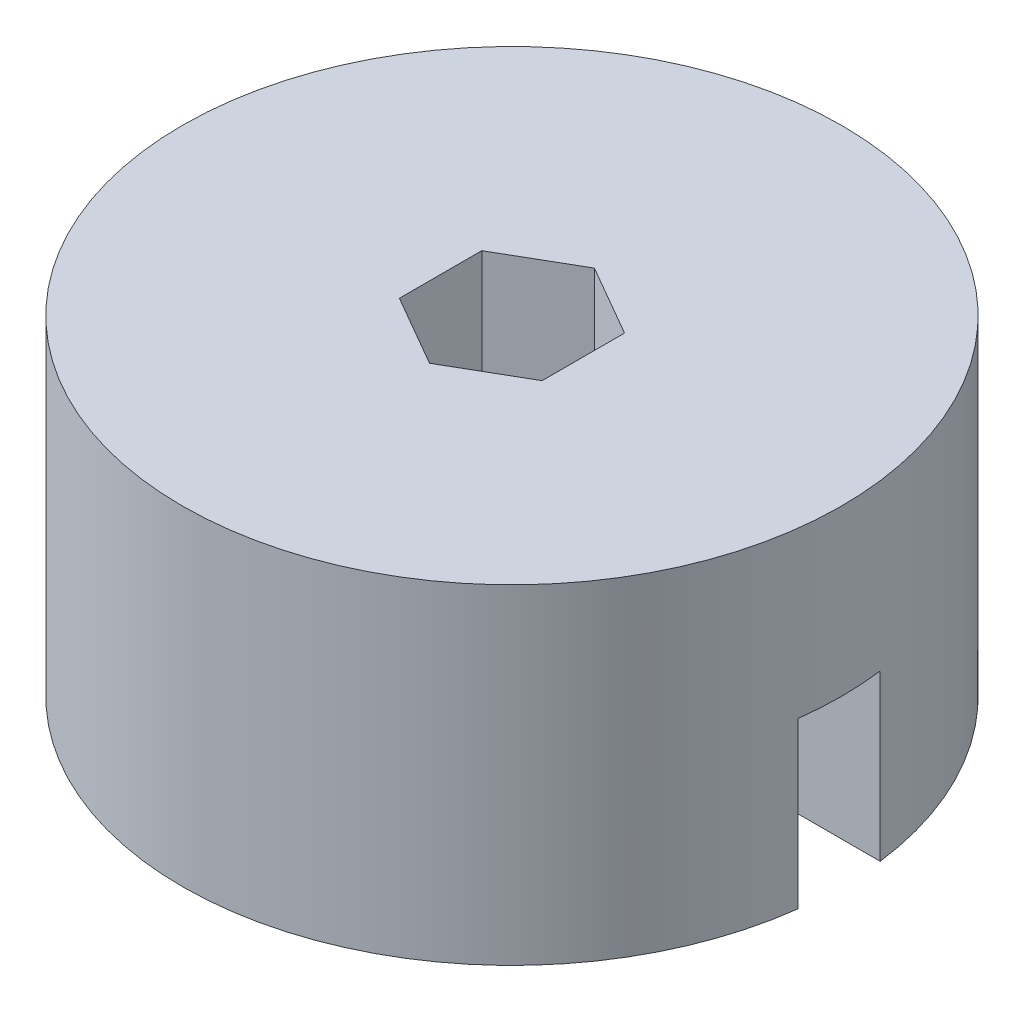
ISO-10303-21;
HEADER;
FILE_DESCRIPTION(('STEP AP214'),'2;1');
FILE_NAME('part.step','',(''),(''),'','','');
FILE_SCHEMA(('AUTOMOTIVE_DESIGN { 1 0 10303 214 1 1 1 1 }'));
ENDSEC;
DATA;
#1=APPLICATION_CONTEXT('core data for automotive mechanical design processes');
#2=APPLICATION_PROTOCOL_DEFINITION('international standard','automotive_design',2000,#1);
#3=PRODUCT_CONTEXT('',#1,'mechanical');
#4=PRODUCT('Part','Part','',(#3));
#5=PRODUCT_RELATED_PRODUCT_CATEGORY('part','',(#4));
#6=PRODUCT_DEFINITION_FORMATION('','',#4);
#7=PRODUCT_DEFINITION_CONTEXT('part definition',#1,'design');
#8=PRODUCT_DEFINITION('design','',#6,#7);
#9=PRODUCT_DEFINITION_SHAPE('','',#8);
#10=(LENGTH_UNIT() NAMED_UNIT(*) SI_UNIT(.MILLI.,.METRE.));
#11=(NAMED_UNIT(*) PLANE_ANGLE_UNIT() SI_UNIT($,.RADIAN.));
#12=(NAMED_UNIT(*) SI_UNIT($,.STERADIAN.) SOLID_ANGLE_UNIT());
#13=UNCERTAINTY_MEASURE_WITH_UNIT(LENGTH_MEASURE(1.E-05),#10,'distance_accuracy_value','');
#14=(GEOMETRIC_REPRESENTATION_CONTEXT(3) GLOBAL_UNCERTAINTY_ASSIGNED_CONTEXT((#13)) GLOBAL_UNIT_ASSIGNED_CONTEXT((#10,
#11,#12)) REPRESENTATION_CONTEXT('',''));
#15=CARTESIAN_POINT('',(0.,0.,0.));
#16=DIRECTION('',(0.,0.,1.));
#17=DIRECTION('',(1.,0.,0.));
#18=AXIS2_PLACEMENT_3D('',#15,#16,#17);
#19=CARTESIAN_POINT('',(5.49926131403118,25.4,0.));
#20=DIRECTION('',(-1.,0.,0.));
#21=DIRECTION('',(0.,0.,1.));
#22=AXIS2_PLACEMENT_3D('',#19,#20,#21);
#23=PLANE('',#22);
#24=DIRECTION('',(0.,0.,-1.));
#25=VECTOR('',#24,1.);
#26=CARTESIAN_POINT('',(5.49926131403118,12.7,0.));
#27=LINE('',#26,#25);
#28=CARTESIAN_POINT('',(5.49926131403118,12.7,3.175));
#29=VERTEX_POINT('',#28);
#30=CARTESIAN_POINT('',(5.49926131403118,12.7,-3.17500000000001));
#31=VERTEX_POINT('',#30);
#32=EDGE_CURVE('E167',#29,#31,#27,.T.);
#33=ORIENTED_EDGE('',*,*,#32,.F.);
#34=DIRECTION('',(0.,-1.,0.));
#35=VECTOR('',#34,1.);
#36=CARTESIAN_POINT('',(5.49926131403118,25.4,3.175));
#37=LINE('',#36,#35);
#38=CARTESIAN_POINT('',(5.49926131403118,25.4,3.175));
#39=VERTEX_POINT('',#38);
#40=EDGE_CURVE('E11',#39,#29,#37,.T.);
#41=ORIENTED_EDGE('',*,*,#40,.F.);
#42=DIRECTION('',(0.,0.,-1.));
#43=VECTOR('',#42,1.);
#44=CARTESIAN_POINT('',(5.49926131403118,25.4,0.));
#45=LINE('',#44,#43);
#46=CARTESIAN_POINT('',(5.49926131403118,25.4,-3.17500000000001));
#47=VERTEX_POINT('',#46);
#48=EDGE_CURVE('E142',#39,#47,#45,.T.);
#49=ORIENTED_EDGE('',*,*,#48,.T.);
#50=DIRECTION('',(0.,-1.,0.));
#51=VECTOR('',#50,1.);
#52=CARTESIAN_POINT('',(5.49926131403118,25.4,-3.17500000000001));
#53=LINE('',#52,#51);
#54=EDGE_CURVE('E49',#47,#31,#53,.T.);
#55=ORIENTED_EDGE('',*,*,#54,.T.);
#56=EDGE_LOOP('',(#33,#41,#49,#55));
#57=FACE_BOUND('',#56,.T.);
#58=ADVANCED_FACE('F33',(#57),#23,.T.);
#59=CARTESIAN_POINT('',(2.74963065701559,25.4,4.7625));
#60=DIRECTION('',(-0.5,0.,-0.866025403784439));
#61=DIRECTION('',(-0.866025403784439,0.,0.5));
#62=AXIS2_PLACEMENT_3D('',#59,#60,#61);
#63=PLANE('',#62);
#64=DIRECTION('',(0.866025403784439,0.,-0.5));
#65=VECTOR('',#64,1.);
#66=CARTESIAN_POINT('',(2.74963065701559,0.,4.7625));
#67=LINE('',#66,#65);
#68=CARTESIAN_POINT('',(0.,0.,6.35));
#69=VERTEX_POINT('',#68);
#70=CARTESIAN_POINT('',(5.49926131403118,0.,3.175));
#71=VERTEX_POINT('',#70);
#72=EDGE_CURVE('E126',#69,#71,#67,.T.);
#73=ORIENTED_EDGE('',*,*,#72,.F.);
#74=DIRECTION('',(0.,-1.,0.));
#75=VECTOR('',#74,1.);
#76=CARTESIAN_POINT('',(0.,25.4,6.35));
#77=LINE('',#76,#75);
#78=CARTESIAN_POINT('',(0.,25.4,6.35));
#79=VERTEX_POINT('',#78);
#80=EDGE_CURVE('E41',#79,#69,#77,.T.);
#81=ORIENTED_EDGE('',*,*,#80,.F.);
#82=DIRECTION('',(0.866025403784439,0.,-0.5));
#83=VECTOR('',#82,1.);
#84=CARTESIAN_POINT('',(2.74963065701559,25.4,4.7625));
#85=LINE('',#84,#83);
#86=EDGE_CURVE('E168',#79,#39,#85,.T.);
#87=ORIENTED_EDGE('',*,*,#86,.T.);
#88=ORIENTED_EDGE('',*,*,#40,.T.);
#89=DIRECTION('',(0.,-1.,0.));
#90=VECTOR('',#89,1.);
#91=CARTESIAN_POINT('',(5.49926131403118,12.7,3.175));
#92=LINE('',#91,#90);
#93=EDGE_CURVE('E154',#29,#71,#92,.T.);
#94=ORIENTED_EDGE('',*,*,#93,.T.);
#95=EDGE_LOOP('',(#73,#81,#87,#88,#94));
#96=FACE_BOUND('',#95,.T.);
#97=ADVANCED_FACE('F152',(#96),#63,.T.);
#98=CARTESIAN_POINT('',(-2.74963065701559,25.4,4.7625));
#99=DIRECTION('',(0.5,0.,-0.866025403784439));
#100=DIRECTION('',(-0.866025403784439,0.,-0.5));
#101=AXIS2_PLACEMENT_3D('',#98,#99,#100);
#102=PLANE('',#101);
#103=DIRECTION('',(0.866025403784439,0.,0.5));
#104=VECTOR('',#103,1.);
#105=CARTESIAN_POINT('',(-2.74963065701559,0.,4.7625));
#106=LINE('',#105,#104);
#107=CARTESIAN_POINT('',(-5.49926131403118,0.,3.175));
#108=VERTEX_POINT('',#107);
#109=EDGE_CURVE('E129',#108,#69,#106,.T.);
#110=ORIENTED_EDGE('',*,*,#109,.F.);
#111=DIRECTION('',(0.,-1.,0.));
#112=VECTOR('',#111,1.);
#113=CARTESIAN_POINT('',(-5.49926131403118,25.4,3.175));
#114=LINE('',#113,#112);
#115=CARTESIAN_POINT('',(-5.49926131403118,25.4,3.175));
#116=VERTEX_POINT('',#115);
#117=EDGE_CURVE('E104',#116,#108,#114,.T.);
#118=ORIENTED_EDGE('',*,*,#117,.F.);
#119=DIRECTION('',(0.866025403784439,0.,0.5));
#120=VECTOR('',#119,1.);
#121=CARTESIAN_POINT('',(-2.74963065701559,25.4,4.7625));
#122=LINE('',#121,#120);
#123=EDGE_CURVE('E115',#116,#79,#122,.T.);
#124=ORIENTED_EDGE('',*,*,#123,.T.);
#125=ORIENTED_EDGE('',*,*,#80,.T.);
#126=EDGE_LOOP('',(#110,#118,#124,#125));
#127=FACE_BOUND('',#126,.T.);
#128=ADVANCED_FACE('F148',(#127),#102,.T.);
#129=CARTESIAN_POINT('',(-5.49926131403118,25.4,0.));
#130=DIRECTION('',(1.,0.,0.));
#131=DIRECTION('',(0.,0.,-1.));
#132=AXIS2_PLACEMENT_3D('',#129,#130,#131);
#133=PLANE('',#132);
#134=DIRECTION('',(0.,0.,1.));
#135=VECTOR('',#134,1.);
#136=CARTESIAN_POINT('',(-5.49926131403118,0.,0.));
#137=LINE('',#136,#135);
#138=CARTESIAN_POINT('',(-5.49926131403118,0.,-3.17500000000001));
#139=VERTEX_POINT('',#138);
#140=EDGE_CURVE('E100',#139,#108,#137,.T.);
#141=ORIENTED_EDGE('',*,*,#140,.F.);
#142=DIRECTION('',(0.,-1.,0.));
#143=VECTOR('',#142,1.);
#144=CARTESIAN_POINT('',(-5.49926131403118,25.4,-3.17500000000001));
#145=LINE('',#144,#143);
#146=CARTESIAN_POINT('',(-5.49926131403118,25.4,-3.17500000000001));
#147=VERTEX_POINT('',#146);
#148=EDGE_CURVE('E95',#147,#139,#145,.T.);
#149=ORIENTED_EDGE('',*,*,#148,.F.);
#150=DIRECTION('',(0.,0.,1.));
#151=VECTOR('',#150,1.);
#152=CARTESIAN_POINT('',(-5.49926131403118,25.4,0.));
#153=LINE('',#152,#151);
#154=EDGE_CURVE('E98',#147,#116,#153,.T.);
#155=ORIENTED_EDGE('',*,*,#154,.T.);
#156=ORIENTED_EDGE('',*,*,#117,.T.);
#157=EDGE_LOOP('',(#141,#149,#155,#156));
#158=FACE_BOUND('',#157,.T.);
#159=ADVANCED_FACE('F97',(#158),#133,.T.);
#160=CARTESIAN_POINT('',(-2.74963065701559,25.4,-4.7625));
#161=DIRECTION('',(0.5,0.,0.866025403784439));
#162=DIRECTION('',(0.866025403784439,0.,-0.5));
#163=AXIS2_PLACEMENT_3D('',#160,#161,#162);
#164=PLANE('',#163);
#165=DIRECTION('',(-0.866025403784439,0.,0.5));
#166=VECTOR('',#165,1.);
#167=CARTESIAN_POINT('',(-2.74963065701559,0.,-4.7625));
#168=LINE('',#167,#166);
#169=CARTESIAN_POINT('',(0.,0.,-6.35));
#170=VERTEX_POINT('',#169);
#171=EDGE_CURVE('E134',#170,#139,#168,.T.);
#172=ORIENTED_EDGE('',*,*,#171,.F.);
#173=DIRECTION('',(0.,-1.,0.));
#174=VECTOR('',#173,1.);
#175=CARTESIAN_POINT('',(0.,25.4,-6.35));
#176=LINE('',#175,#174);
#177=CARTESIAN_POINT('',(0.,25.4,-6.35));
#178=VERTEX_POINT('',#177);
#179=EDGE_CURVE('E68',#178,#170,#176,.T.);
#180=ORIENTED_EDGE('',*,*,#179,.F.);
#181=DIRECTION('',(-0.866025403784439,0.,0.5));
#182=VECTOR('',#181,1.);
#183=CARTESIAN_POINT('',(-2.74963065701559,25.4,-4.7625));
#184=LINE('',#183,#182);
#185=EDGE_CURVE('E112',#178,#147,#184,.T.);
#186=ORIENTED_EDGE('',*,*,#185,.T.);
#187=ORIENTED_EDGE('',*,*,#148,.T.);
#188=EDGE_LOOP('',(#172,#180,#186,#187));
#189=FACE_BOUND('',#188,.T.);
#190=ADVANCED_FACE('F117',(#189),#164,.T.);
#191=CARTESIAN_POINT('',(2.74963065701559,25.4,-4.7625));
#192=DIRECTION('',(-0.5,0.,0.866025403784439));
#193=DIRECTION('',(0.866025403784439,0.,0.5));
#194=AXIS2_PLACEMENT_3D('',#191,#192,#193);
#195=PLANE('',#194);
#196=DIRECTION('',(-0.866025403784439,0.,-0.5));
#197=VECTOR('',#196,1.);
#198=CARTESIAN_POINT('',(2.74963065701559,0.,-4.7625));
#199=LINE('',#198,#197);
#200=CARTESIAN_POINT('',(5.49926131403118,0.,-3.17500000000001));
#201=VERTEX_POINT('',#200);
#202=EDGE_CURVE('E136',#201,#170,#199,.T.);
#203=ORIENTED_EDGE('',*,*,#202,.F.);
#204=DIRECTION('',(0.,-1.,0.));
#205=VECTOR('',#204,1.);
#206=CARTESIAN_POINT('',(5.49926131403118,12.7,-3.17500000000001));
#207=LINE('',#206,#205);
#208=EDGE_CURVE('E75',#31,#201,#207,.T.);
#209=ORIENTED_EDGE('',*,*,#208,.F.);
#210=ORIENTED_EDGE('',*,*,#54,.F.);
#211=DIRECTION('',(-0.866025403784439,0.,-0.5));
#212=VECTOR('',#211,1.);
#213=CARTESIAN_POINT('',(2.74963065701559,25.4,-4.7625));
#214=LINE('',#213,#212);
#215=EDGE_CURVE('E118',#47,#178,#214,.T.);
#216=ORIENTED_EDGE('',*,*,#215,.T.);
#217=ORIENTED_EDGE('',*,*,#179,.T.);
#218=EDGE_LOOP('',(#203,#209,#210,#216,#217));
#219=FACE_BOUND('',#218,.T.);
#220=ADVANCED_FACE('F160',(#219),#195,.T.);
#221=CARTESIAN_POINT('',(0.,25.4,0.));
#222=DIRECTION('',(0.,-1.,0.));
#223=DIRECTION('',(0.,0.,-1.));
#224=AXIS2_PLACEMENT_3D('',#221,#222,#223);
#225=CYLINDRICAL_SURFACE('',#224,25.4);
#226=CARTESIAN_POINT('',(0.,0.,0.));
#227=DIRECTION('',(0.,1.,0.));
#228=DIRECTION('',(0.,0.,1.));
#229=AXIS2_PLACEMENT_3D('',#226,#227,#228);
#230=CIRCLE('',#229,25.4);
#231=CARTESIAN_POINT('',(25.2007812378902,0.,-3.17500000000001));
#232=VERTEX_POINT('',#231);
#233=CARTESIAN_POINT('',(25.2007812378902,0.,3.175));
#234=VERTEX_POINT('',#233);
#235=EDGE_CURVE('E139',#232,#234,#230,.T.);
#236=ORIENTED_EDGE('',*,*,#235,.T.);
#237=DIRECTION('',(0.,-1.,0.));
#238=VECTOR('',#237,1.);
#239=CARTESIAN_POINT('',(25.2007812378902,12.7,3.175));
#240=LINE('',#239,#238);
#241=CARTESIAN_POINT('',(25.2007812378902,12.7,3.175));
#242=VERTEX_POINT('',#241);
#243=EDGE_CURVE('E130',#242,#234,#240,.T.);
#244=ORIENTED_EDGE('',*,*,#243,.F.);
#245=CARTESIAN_POINT('',(0.,12.7,0.));
#246=DIRECTION('',(0.,1.,0.));
#247=DIRECTION('',(0.,0.,1.));
#248=AXIS2_PLACEMENT_3D('',#245,#246,#247);
#249=CIRCLE('',#248,25.4);
#250=CARTESIAN_POINT('',(25.2007812378902,12.7,-3.17500000000001));
#251=VERTEX_POINT('',#250);
#252=EDGE_CURVE('E186',#242,#251,#249,.T.);
#253=ORIENTED_EDGE('',*,*,#252,.T.);
#254=DIRECTION('',(0.,-1.,0.));
#255=VECTOR('',#254,1.);
#256=CARTESIAN_POINT('',(25.2007812378902,12.7,-3.17500000000001));
#257=LINE('',#256,#255);
#258=EDGE_CURVE('E164',#251,#232,#257,.T.);
#259=ORIENTED_EDGE('',*,*,#258,.T.);
#260=EDGE_LOOP('',(#236,#244,#253,#259));
#261=FACE_BOUND('',#260,.T.);
#262=CARTESIAN_POINT('',(0.,25.4,0.));
#263=DIRECTION('',(0.,1.,0.));
#264=DIRECTION('',(0.,0.,1.));
#265=AXIS2_PLACEMENT_3D('',#262,#263,#264);
#266=CIRCLE('',#265,25.4);
#267=CARTESIAN_POINT('',(0.,25.4,25.4));
#268=VERTEX_POINT('',#267);
#269=EDGE_CURVE('E120',#268,#268,#266,.T.);
#270=ORIENTED_EDGE('',*,*,#269,.F.);
#271=EDGE_LOOP('',(#270));
#272=FACE_BOUND('',#271,.T.);
#273=ADVANCED_FACE('F202',(#261,#272),#225,.T.);
#274=CARTESIAN_POINT('',(0.,25.4,0.));
#275=DIRECTION('',(0.,1.,0.));
#276=DIRECTION('',(0.,0.,1.));
#277=AXIS2_PLACEMENT_3D('',#274,#275,#276);
#278=PLANE('',#277);
#279=ORIENTED_EDGE('',*,*,#48,.F.);
#280=ORIENTED_EDGE('',*,*,#86,.F.);
#281=ORIENTED_EDGE('',*,*,#123,.F.);
#282=ORIENTED_EDGE('',*,*,#154,.F.);
#283=ORIENTED_EDGE('',*,*,#185,.F.);
#284=ORIENTED_EDGE('',*,*,#215,.F.);
#285=EDGE_LOOP('',(#279,#280,#281,#282,#283,#284));
#286=FACE_BOUND('',#285,.T.);
#287=ORIENTED_EDGE('',*,*,#269,.T.);
#288=EDGE_LOOP('',(#287));
#289=FACE_BOUND('',#288,.T.);
#290=ADVANCED_FACE('F109',(#286,#289),#278,.T.);
#291=CARTESIAN_POINT('',(0.,0.,0.));
#292=DIRECTION('',(0.,1.,0.));
#293=DIRECTION('',(0.,0.,1.));
#294=AXIS2_PLACEMENT_3D('',#291,#292,#293);
#295=PLANE('',#294);
#296=ORIENTED_EDGE('',*,*,#72,.T.);
#297=DIRECTION('',(-1.,0.,0.));
#298=VECTOR('',#297,1.);
#299=CARTESIAN_POINT('',(0.,0.,3.175));
#300=LINE('',#299,#298);
#301=EDGE_CURVE('E179',#234,#71,#300,.T.);
#302=ORIENTED_EDGE('',*,*,#301,.F.);
#303=ORIENTED_EDGE('',*,*,#235,.F.);
#304=DIRECTION('',(1.,0.,0.));
#305=VECTOR('',#304,1.);
#306=CARTESIAN_POINT('',(0.,0.,-3.17500000000001));
#307=LINE('',#306,#305);
#308=EDGE_CURVE('E159',#201,#232,#307,.T.);
#309=ORIENTED_EDGE('',*,*,#308,.F.);
#310=ORIENTED_EDGE('',*,*,#202,.T.);
#311=ORIENTED_EDGE('',*,*,#171,.T.);
#312=ORIENTED_EDGE('',*,*,#140,.T.);
#313=ORIENTED_EDGE('',*,*,#109,.T.);
#314=EDGE_LOOP('',(#296,#302,#303,#309,#310,#311,#312,#313));
#315=FACE_BOUND('',#314,.T.);
#316=ADVANCED_FACE('F157',(#315),#295,.F.);
#317=CARTESIAN_POINT('',(0.,12.7,3.175));
#318=DIRECTION('',(0.,0.,1.));
#319=DIRECTION('',(1.,0.,0.));
#320=AXIS2_PLACEMENT_3D('',#317,#318,#319);
#321=PLANE('',#320);
#322=ORIENTED_EDGE('',*,*,#301,.T.);
#323=ORIENTED_EDGE('',*,*,#93,.F.);
#324=DIRECTION('',(-1.,0.,0.));
#325=VECTOR('',#324,1.);
#326=CARTESIAN_POINT('',(0.,12.7,3.175));
#327=LINE('',#326,#325);
#328=EDGE_CURVE('E178',#242,#29,#327,.T.);
#329=ORIENTED_EDGE('',*,*,#328,.F.);
#330=ORIENTED_EDGE('',*,*,#243,.T.);
#331=EDGE_LOOP('',(#322,#323,#329,#330));
#332=FACE_BOUND('',#331,.T.);
#333=ADVANCED_FACE('F198',(#332),#321,.F.);
#334=CARTESIAN_POINT('',(0.,12.7,-3.17500000000001));
#335=DIRECTION('',(0.,0.,-1.));
#336=DIRECTION('',(-1.,0.,0.));
#337=AXIS2_PLACEMENT_3D('',#334,#335,#336);
#338=PLANE('',#337);
#339=ORIENTED_EDGE('',*,*,#308,.T.);
#340=ORIENTED_EDGE('',*,*,#258,.F.);
#341=DIRECTION('',(1.,0.,0.));
#342=VECTOR('',#341,1.);
#343=CARTESIAN_POINT('',(0.,12.7,-3.17500000000001));
#344=LINE('',#343,#342);
#345=EDGE_CURVE('E183',#31,#251,#344,.T.);
#346=ORIENTED_EDGE('',*,*,#345,.F.);
#347=ORIENTED_EDGE('',*,*,#208,.T.);
#348=EDGE_LOOP('',(#339,#340,#346,#347));
#349=FACE_BOUND('',#348,.T.);
#350=ADVANCED_FACE('F208',(#349),#338,.F.);
#351=CARTESIAN_POINT('',(0.,12.7,0.));
#352=DIRECTION('',(0.,1.,0.));
#353=DIRECTION('',(0.,0.,1.));
#354=AXIS2_PLACEMENT_3D('',#351,#352,#353);
#355=PLANE('',#354);
#356=ORIENTED_EDGE('',*,*,#328,.T.);
#357=ORIENTED_EDGE('',*,*,#32,.T.);
#358=ORIENTED_EDGE('',*,*,#345,.T.);
#359=ORIENTED_EDGE('',*,*,#252,.F.);
#360=EDGE_LOOP('',(#356,#357,#358,#359));
#361=FACE_BOUND('',#360,.T.);
#362=ADVANCED_FACE('F193',(#361),#355,.F.);
#363=CLOSED_SHELL('',(#58,#97,#128,#159,#190,#220,#273,#290,#316,#333,#350,#362));
#364=MANIFOLD_SOLID_BREP('B2',#363);
#365=ADVANCED_BREP_SHAPE_REPRESENTATION('',(#18,#364),#14);
#366=SHAPE_DEFINITION_REPRESENTATION(#9,#365);
ENDSEC;
END-ISO-10303-21;
